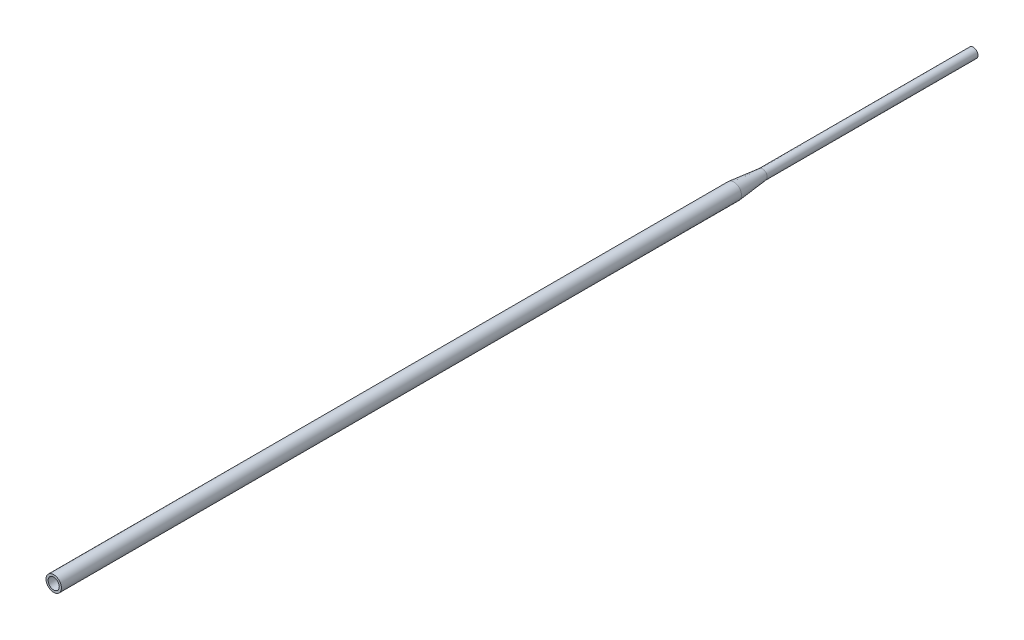
ISO-10303-21;
HEADER;
FILE_DESCRIPTION(('STEP AP214'),'2;1');
FILE_NAME('part.step','',(''),(''),'','','');
FILE_SCHEMA(('AUTOMOTIVE_DESIGN { 1 0 10303 214 1 1 1 1 }'));
ENDSEC;
DATA;
#1=APPLICATION_CONTEXT('core data for automotive mechanical design processes');
#2=APPLICATION_PROTOCOL_DEFINITION('international standard','automotive_design',2000,#1);
#3=PRODUCT_CONTEXT('',#1,'mechanical');
#4=PRODUCT('Part','Part','',(#3));
#5=PRODUCT_RELATED_PRODUCT_CATEGORY('part','',(#4));
#6=PRODUCT_DEFINITION_FORMATION('','',#4);
#7=PRODUCT_DEFINITION_CONTEXT('part definition',#1,'design');
#8=PRODUCT_DEFINITION('design','',#6,#7);
#9=PRODUCT_DEFINITION_SHAPE('','',#8);
#10=(LENGTH_UNIT() NAMED_UNIT(*) SI_UNIT(.MILLI.,.METRE.));
#11=(NAMED_UNIT(*) PLANE_ANGLE_UNIT() SI_UNIT($,.RADIAN.));
#12=(NAMED_UNIT(*) SI_UNIT($,.STERADIAN.) SOLID_ANGLE_UNIT());
#13=UNCERTAINTY_MEASURE_WITH_UNIT(LENGTH_MEASURE(1.E-05),#10,'distance_accuracy_value','');
#14=(GEOMETRIC_REPRESENTATION_CONTEXT(3) GLOBAL_UNCERTAINTY_ASSIGNED_CONTEXT((#13)) GLOBAL_UNIT_ASSIGNED_CONTEXT((#10,
#11,#12)) REPRESENTATION_CONTEXT('',''));
#15=CARTESIAN_POINT('',(0.,0.,0.));
#16=DIRECTION('',(0.,0.,1.));
#17=DIRECTION('',(1.,0.,0.));
#18=AXIS2_PLACEMENT_3D('',#15,#16,#17);
#19=CARTESIAN_POINT('',(-7.62,0.,236.448520774754));
#20=DIRECTION('',(0.,0.,1.));
#21=DIRECTION('',(1.,0.,0.));
#22=AXIS2_PLACEMENT_3D('',#19,#20,#21);
#23=PLANE('',#22);
#24=CARTESIAN_POINT('',(0.,0.,236.448520774754));
#25=DIRECTION('',(0.,0.,-1.));
#26=DIRECTION('',(-1.,0.,0.));
#27=AXIS2_PLACEMENT_3D('',#24,#25,#26);
#28=CIRCLE('',#27,5.08);
#29=CARTESIAN_POINT('',(-5.08,0.,236.448520774754));
#30=VERTEX_POINT('',#29);
#31=EDGE_CURVE('E68',#30,#30,#28,.T.);
#32=ORIENTED_EDGE('',*,*,#31,.T.);
#33=EDGE_LOOP('',(#32));
#34=FACE_BOUND('',#33,.T.);
#35=CARTESIAN_POINT('',(0.,0.,236.448520774754));
#36=DIRECTION('',(0.,0.,1.));
#37=DIRECTION('',(1.,0.,0.));
#38=AXIS2_PLACEMENT_3D('',#35,#36,#37);
#39=CIRCLE('',#38,5.5);
#40=CARTESIAN_POINT('',(5.5,0.,236.448520774754));
#41=VERTEX_POINT('',#40);
#42=EDGE_CURVE('E10',#41,#41,#39,.F.);
#43=ORIENTED_EDGE('',*,*,#42,.F.);
#44=EDGE_LOOP('',(#43));
#45=FACE_BOUND('',#44,.T.);
#46=ADVANCED_FACE('F39',(#34,#45),#23,.T.);
#47=CARTESIAN_POINT('',(0.,0.,0.));
#48=DIRECTION('',(0.,0.,1.));
#49=DIRECTION('',(1.,0.,0.));
#50=AXIS2_PLACEMENT_3D('',#47,#48,#49);
#51=PLANE('',#50);
#52=CARTESIAN_POINT('',(0.,0.,0.));
#53=DIRECTION('',(0.,0.,1.));
#54=DIRECTION('',(1.,0.,0.));
#55=AXIS2_PLACEMENT_3D('',#52,#53,#54);
#56=CIRCLE('',#55,4.699);
#57=CARTESIAN_POINT('',(4.699,0.,0.));
#58=VERTEX_POINT('',#57);
#59=EDGE_CURVE('E46',#58,#58,#56,.T.);
#60=ORIENTED_EDGE('',*,*,#59,.F.);
#61=EDGE_LOOP('',(#60));
#62=FACE_BOUND('',#61,.T.);
#63=CARTESIAN_POINT('',(0.,0.,0.));
#64=DIRECTION('',(0.,0.,1.));
#65=DIRECTION('',(1.,0.,0.));
#66=AXIS2_PLACEMENT_3D('',#63,#64,#65);
#67=CIRCLE('',#66,3.75);
#68=CARTESIAN_POINT('',(3.75,0.,0.));
#69=VERTEX_POINT('',#68);
#70=EDGE_CURVE('E50',#69,#69,#67,.T.);
#71=ORIENTED_EDGE('',*,*,#70,.T.);
#72=EDGE_LOOP('',(#71));
#73=FACE_BOUND('',#72,.T.);
#74=ADVANCED_FACE('F103',(#62,#73),#51,.F.);
#75=CARTESIAN_POINT('',(0.,0.,215.9));
#76=DIRECTION('',(0.,0.,-1.));
#77=DIRECTION('',(-1.,0.,0.));
#78=AXIS2_PLACEMENT_3D('',#75,#76,#77);
#79=CYLINDRICAL_SURFACE('',#78,4.699);
#80=CARTESIAN_POINT('',(0.,0.,208.123650762406));
#81=DIRECTION('',(0.,0.,-1.));
#82=DIRECTION('',(-1.,0.,0.));
#83=AXIS2_PLACEMENT_3D('',#80,#81,#82);
#84=CIRCLE('',#83,4.699);
#85=CARTESIAN_POINT('',(-4.699,0.,208.123650762406));
#86=VERTEX_POINT('',#85);
#87=EDGE_CURVE('E71',#86,#86,#84,.T.);
#88=ORIENTED_EDGE('',*,*,#87,.T.);
#89=EDGE_LOOP('',(#88));
#90=FACE_BOUND('',#89,.T.);
#91=ORIENTED_EDGE('',*,*,#59,.T.);
#92=EDGE_LOOP('',(#91));
#93=FACE_BOUND('',#92,.T.);
#94=ADVANCED_FACE('F41',(#90,#93),#79,.T.);
#95=CARTESIAN_POINT('',(0.,0.,215.9));
#96=DIRECTION('',(0.,0.,-1.));
#97=DIRECTION('',(-1.,0.,0.));
#98=AXIS2_PLACEMENT_3D('',#95,#96,#97);
#99=CYLINDRICAL_SURFACE('',#98,3.75);
#100=CARTESIAN_POINT('',(0.,0.,215.9));
#101=DIRECTION('',(0.,0.,-1.));
#102=DIRECTION('',(-1.,0.,0.));
#103=AXIS2_PLACEMENT_3D('',#100,#101,#102);
#104=CIRCLE('',#103,3.75);
#105=CARTESIAN_POINT('',(-3.75,0.,215.9));
#106=VERTEX_POINT('',#105);
#107=EDGE_CURVE('E54',#106,#106,#104,.T.);
#108=ORIENTED_EDGE('',*,*,#107,.F.);
#109=EDGE_LOOP('',(#108));
#110=FACE_BOUND('',#109,.T.);
#111=ORIENTED_EDGE('',*,*,#70,.F.);
#112=EDGE_LOOP('',(#111));
#113=FACE_BOUND('',#112,.T.);
#114=ADVANCED_FACE('F126',(#110,#113),#99,.F.);
#115=CARTESIAN_POINT('',(-4.699,0.,215.9));
#116=DIRECTION('',(0.,0.,-1.));
#117=DIRECTION('',(-1.,0.,0.));
#118=AXIS2_PLACEMENT_3D('',#115,#116,#117);
#119=PLANE('',#118);
#120=CARTESIAN_POINT('',(0.,0.,215.9));
#121=DIRECTION('',(0.,0.,-1.));
#122=DIRECTION('',(-1.,0.,0.));
#123=AXIS2_PLACEMENT_3D('',#120,#121,#122);
#124=CIRCLE('',#123,3.58);
#125=CARTESIAN_POINT('',(-3.58,0.,215.9));
#126=VERTEX_POINT('',#125);
#127=EDGE_CURVE('E59',#126,#126,#124,.T.);
#128=ORIENTED_EDGE('',*,*,#127,.F.);
#129=EDGE_LOOP('',(#128));
#130=FACE_BOUND('',#129,.T.);
#131=ORIENTED_EDGE('',*,*,#107,.T.);
#132=EDGE_LOOP('',(#131));
#133=FACE_BOUND('',#132,.T.);
#134=ADVANCED_FACE('F122',(#130,#133),#119,.T.);
#135=CARTESIAN_POINT('',(0.,0.,215.9));
#136=DIRECTION('',(0.,0.,-1.));
#137=DIRECTION('',(-1.,0.,0.));
#138=AXIS2_PLACEMENT_3D('',#135,#136,#137);
#139=CYLINDRICAL_SURFACE('',#138,3.58);
#140=ORIENTED_EDGE('',*,*,#127,.T.);
#141=EDGE_LOOP('',(#140));
#142=FACE_BOUND('',#141,.T.);
#143=CARTESIAN_POINT('',(0.,0.,245.9));
#144=DIRECTION('',(0.,0.,-1.));
#145=DIRECTION('',(-1.,0.,0.));
#146=AXIS2_PLACEMENT_3D('',#143,#144,#145);
#147=CIRCLE('',#146,3.58);
#148=CARTESIAN_POINT('',(-3.58,0.,245.9));
#149=VERTEX_POINT('',#148);
#150=EDGE_CURVE('E62',#149,#149,#147,.T.);
#151=ORIENTED_EDGE('',*,*,#150,.F.);
#152=EDGE_LOOP('',(#151));
#153=FACE_BOUND('',#152,.T.);
#154=ADVANCED_FACE('F118',(#142,#153),#139,.F.);
#155=CARTESIAN_POINT('',(-5.08,0.,245.9));
#156=DIRECTION('',(0.,0.,1.));
#157=DIRECTION('',(1.,0.,0.));
#158=AXIS2_PLACEMENT_3D('',#155,#156,#157);
#159=PLANE('',#158);
#160=ORIENTED_EDGE('',*,*,#150,.T.);
#161=EDGE_LOOP('',(#160));
#162=FACE_BOUND('',#161,.T.);
#163=CARTESIAN_POINT('',(0.,0.,245.9));
#164=DIRECTION('',(0.,0.,-1.));
#165=DIRECTION('',(-1.,0.,0.));
#166=AXIS2_PLACEMENT_3D('',#163,#164,#165);
#167=CIRCLE('',#166,5.08);
#168=CARTESIAN_POINT('',(-5.08,0.,245.9));
#169=VERTEX_POINT('',#168);
#170=EDGE_CURVE('E65',#169,#169,#167,.T.);
#171=ORIENTED_EDGE('',*,*,#170,.F.);
#172=EDGE_LOOP('',(#171));
#173=FACE_BOUND('',#172,.T.);
#174=ADVANCED_FACE('F114',(#162,#173),#159,.T.);
#175=CARTESIAN_POINT('',(0.,0.,215.9));
#176=DIRECTION('',(0.,0.,-1.));
#177=DIRECTION('',(-1.,0.,0.));
#178=AXIS2_PLACEMENT_3D('',#175,#176,#177);
#179=CYLINDRICAL_SURFACE('',#178,5.08);
#180=ORIENTED_EDGE('',*,*,#170,.T.);
#181=EDGE_LOOP('',(#180));
#182=FACE_BOUND('',#181,.T.);
#183=ORIENTED_EDGE('',*,*,#31,.F.);
#184=EDGE_LOOP('',(#183));
#185=FACE_BOUND('',#184,.T.);
#186=ADVANCED_FACE('F99',(#182,#185),#179,.T.);
#187=CARTESIAN_POINT('',(0.,0.,208.123650762406));
#188=DIRECTION('',(0.,0.,1.));
#189=DIRECTION('',(1.,0.,0.));
#190=AXIS2_PLACEMENT_3D('',#187,#188,#189);
#191=CONICAL_SURFACE('',#190,4.699,0.102761667456287);
#192=CARTESIAN_POINT('',(0.,0.,236.448520774754));
#193=DIRECTION('',(0.,0.,1.));
#194=DIRECTION('',(1.,0.,0.));
#195=AXIS2_PLACEMENT_3D('',#192,#193,#194);
#196=CIRCLE('',#195,7.62);
#197=CARTESIAN_POINT('',(7.62,0.,236.448520774754));
#198=VERTEX_POINT('',#197);
#199=EDGE_CURVE('E75',#198,#198,#196,.T.);
#200=ORIENTED_EDGE('',*,*,#199,.F.);
#201=EDGE_LOOP('',(#200));
#202=FACE_BOUND('',#201,.T.);
#203=ORIENTED_EDGE('',*,*,#87,.F.);
#204=EDGE_LOOP('',(#203));
#205=FACE_BOUND('',#204,.T.);
#206=ADVANCED_FACE('F89',(#202,#205),#191,.T.);
#207=CARTESIAN_POINT('',(0.,0.,908.048520774754));
#208=DIRECTION('',(0.,0.,1.));
#209=DIRECTION('',(1.,0.,0.));
#210=AXIS2_PLACEMENT_3D('',#207,#208,#209);
#211=PLANE('',#210);
#212=CARTESIAN_POINT('',(0.,0.,908.048520774754));
#213=DIRECTION('',(0.,0.,1.));
#214=DIRECTION('',(1.,0.,0.));
#215=AXIS2_PLACEMENT_3D('',#212,#213,#214);
#216=CIRCLE('',#215,7.62);
#217=CARTESIAN_POINT('',(7.62,0.,908.048520774754));
#218=VERTEX_POINT('',#217);
#219=EDGE_CURVE('E74',#218,#218,#216,.T.);
#220=ORIENTED_EDGE('',*,*,#219,.T.);
#221=EDGE_LOOP('',(#220));
#222=FACE_BOUND('',#221,.T.);
#223=CARTESIAN_POINT('',(0.,0.,908.048520774754));
#224=DIRECTION('',(0.,0.,1.));
#225=DIRECTION('',(1.,0.,0.));
#226=AXIS2_PLACEMENT_3D('',#223,#224,#225);
#227=CIRCLE('',#226,5.5);
#228=CARTESIAN_POINT('',(5.5,0.,908.048520774754));
#229=VERTEX_POINT('',#228);
#230=EDGE_CURVE('E78',#229,#229,#227,.T.);
#231=ORIENTED_EDGE('',*,*,#230,.F.);
#232=EDGE_LOOP('',(#231));
#233=FACE_BOUND('',#232,.T.);
#234=ADVANCED_FACE('F86',(#222,#233),#211,.T.);
#235=CARTESIAN_POINT('',(0.,0.,908.048520774754));
#236=DIRECTION('',(0.,0.,-1.));
#237=DIRECTION('',(-1.,0.,0.));
#238=AXIS2_PLACEMENT_3D('',#235,#236,#237);
#239=CYLINDRICAL_SURFACE('',#238,7.62);
#240=ORIENTED_EDGE('',*,*,#219,.F.);
#241=EDGE_LOOP('',(#240));
#242=FACE_BOUND('',#241,.T.);
#243=ORIENTED_EDGE('',*,*,#199,.T.);
#244=EDGE_LOOP('',(#243));
#245=FACE_BOUND('',#244,.T.);
#246=ADVANCED_FACE('F88',(#242,#245),#239,.T.);
#247=CARTESIAN_POINT('',(0.,0.,908.048520774754));
#248=DIRECTION('',(0.,0.,-1.));
#249=DIRECTION('',(-1.,0.,0.));
#250=AXIS2_PLACEMENT_3D('',#247,#248,#249);
#251=CYLINDRICAL_SURFACE('',#250,5.5);
#252=ORIENTED_EDGE('',*,*,#230,.T.);
#253=EDGE_LOOP('',(#252));
#254=FACE_BOUND('',#253,.T.);
#255=ORIENTED_EDGE('',*,*,#42,.T.);
#256=EDGE_LOOP('',(#255));
#257=FACE_BOUND('',#256,.T.);
#258=ADVANCED_FACE('F84',(#254,#257),#251,.F.);
#259=CLOSED_SHELL('',(#46,#74,#94,#114,#134,#154,#174,#186,#206,#234,#246,#258));
#260=MANIFOLD_SOLID_BREP('B2',#259);
#261=ADVANCED_BREP_SHAPE_REPRESENTATION('',(#18,#260),#14);
#262=SHAPE_DEFINITION_REPRESENTATION(#9,#261);
ENDSEC;
END-ISO-10303-21;
